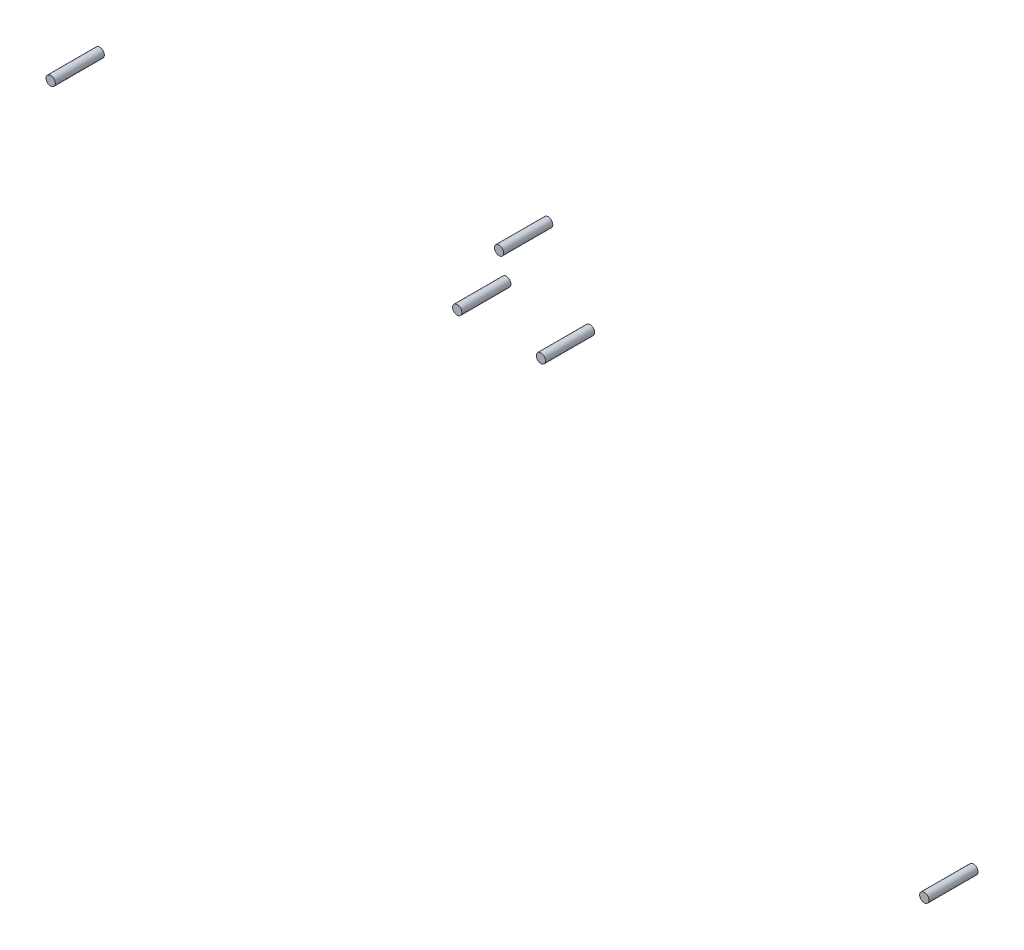
ISO-10303-21;
HEADER;
FILE_DESCRIPTION(('STEP AP214'),'2;1');
FILE_NAME('part.step','',(''),(''),'','','');
FILE_SCHEMA(('AUTOMOTIVE_DESIGN { 1 0 10303 214 1 1 1 1 }'));
ENDSEC;
DATA;
#1=APPLICATION_CONTEXT('core data for automotive mechanical design processes');
#2=APPLICATION_PROTOCOL_DEFINITION('international standard','automotive_design',2000,#1);
#3=PRODUCT_CONTEXT('',#1,'mechanical');
#4=PRODUCT('Part','Part','',(#3));
#5=PRODUCT_RELATED_PRODUCT_CATEGORY('part','',(#4));
#6=PRODUCT_DEFINITION_FORMATION('','',#4);
#7=PRODUCT_DEFINITION_CONTEXT('part definition',#1,'design');
#8=PRODUCT_DEFINITION('design','',#6,#7);
#9=PRODUCT_DEFINITION_SHAPE('','',#8);
#10=(LENGTH_UNIT() NAMED_UNIT(*) SI_UNIT(.MILLI.,.METRE.));
#11=(NAMED_UNIT(*) PLANE_ANGLE_UNIT() SI_UNIT($,.RADIAN.));
#12=(NAMED_UNIT(*) SI_UNIT($,.STERADIAN.) SOLID_ANGLE_UNIT());
#13=UNCERTAINTY_MEASURE_WITH_UNIT(LENGTH_MEASURE(1.E-05),#10,'distance_accuracy_value','');
#14=(GEOMETRIC_REPRESENTATION_CONTEXT(3) GLOBAL_UNCERTAINTY_ASSIGNED_CONTEXT((#13)) GLOBAL_UNIT_ASSIGNED_CONTEXT((#10,
#11,#12)) REPRESENTATION_CONTEXT('',''));
#15=CARTESIAN_POINT('',(0.,0.,0.));
#16=DIRECTION('',(0.,0.,1.));
#17=DIRECTION('',(1.,0.,0.));
#18=AXIS2_PLACEMENT_3D('',#15,#16,#17);
#19=CARTESIAN_POINT('',(-66.4999999999998,49.7499999999999,6.35));
#20=DIRECTION('',(0.,0.,-1.));
#21=DIRECTION('',(-1.,0.,0.));
#22=AXIS2_PLACEMENT_3D('',#19,#20,#21);
#23=CYLINDRICAL_SURFACE('',#22,0.600000000000008);
#24=CARTESIAN_POINT('',(-66.4999999999998,49.7499999999999,6.35));
#25=DIRECTION('',(0.,0.,1.));
#26=DIRECTION('',(1.,0.,0.));
#27=AXIS2_PLACEMENT_3D('',#24,#25,#26);
#28=CIRCLE('',#27,0.600000000000008);
#29=CARTESIAN_POINT('',(-65.8999999999998,49.7499999999999,6.35));
#30=VERTEX_POINT('',#29);
#31=EDGE_CURVE('E11',#30,#30,#28,.T.);
#32=ORIENTED_EDGE('',*,*,#31,.F.);
#33=EDGE_LOOP('',(#32));
#34=FACE_BOUND('',#33,.T.);
#35=CARTESIAN_POINT('',(-66.4999999999998,49.7499999999999,0.));
#36=DIRECTION('',(0.,0.,1.));
#37=DIRECTION('',(1.,0.,0.));
#38=AXIS2_PLACEMENT_3D('',#35,#36,#37);
#39=CIRCLE('',#38,0.600000000000008);
#40=CARTESIAN_POINT('',(-65.8999999999998,49.7499999999999,0.));
#41=VERTEX_POINT('',#40);
#42=EDGE_CURVE('E42',#41,#41,#39,.T.);
#43=ORIENTED_EDGE('',*,*,#42,.T.);
#44=EDGE_LOOP('',(#43));
#45=FACE_BOUND('',#44,.T.);
#46=ADVANCED_FACE('F39',(#34,#45),#23,.T.);
#47=CARTESIAN_POINT('',(-66.4999999999998,49.7499999999999,6.35));
#48=DIRECTION('',(0.,0.,1.));
#49=DIRECTION('',(1.,0.,0.));
#50=AXIS2_PLACEMENT_3D('',#47,#48,#49);
#51=PLANE('',#50);
#52=ORIENTED_EDGE('',*,*,#31,.T.);
#53=EDGE_LOOP('',(#52));
#54=FACE_BOUND('',#53,.T.);
#55=ADVANCED_FACE('F54',(#54),#51,.T.);
#56=CARTESIAN_POINT('',(-66.4999999999998,49.7499999999999,0.));
#57=DIRECTION('',(0.,0.,1.));
#58=DIRECTION('',(1.,0.,0.));
#59=AXIS2_PLACEMENT_3D('',#56,#57,#58);
#60=PLANE('',#59);
#61=ORIENTED_EDGE('',*,*,#42,.F.);
#62=EDGE_LOOP('',(#61));
#63=FACE_BOUND('',#62,.T.);
#64=ADVANCED_FACE('F52',(#63),#60,.F.);
#65=CLOSED_SHELL('',(#46,#55,#64));
#66=MANIFOLD_SOLID_BREP('B2',#65);
#67=CARTESIAN_POINT('',(46.5000000000002,14.7499999999999,6.35));
#68=DIRECTION('',(0.,0.,-1.));
#69=DIRECTION('',(-1.,0.,0.));
#70=AXIS2_PLACEMENT_3D('',#67,#68,#69);
#71=CYLINDRICAL_SURFACE('',#70,0.599999999999992);
#72=CARTESIAN_POINT('',(46.5000000000002,14.7499999999999,6.35));
#73=DIRECTION('',(0.,0.,1.));
#74=DIRECTION('',(1.,0.,0.));
#75=AXIS2_PLACEMENT_3D('',#72,#73,#74);
#76=CIRCLE('',#75,0.599999999999992);
#77=CARTESIAN_POINT('',(47.1000000000002,14.7499999999999,6.35));
#78=VERTEX_POINT('',#77);
#79=EDGE_CURVE('E38',#78,#78,#76,.T.);
#80=ORIENTED_EDGE('',*,*,#79,.F.);
#81=EDGE_LOOP('',(#80));
#82=FACE_BOUND('',#81,.T.);
#83=CARTESIAN_POINT('',(46.5000000000002,14.7499999999999,0.));
#84=DIRECTION('',(0.,0.,1.));
#85=DIRECTION('',(1.,0.,0.));
#86=AXIS2_PLACEMENT_3D('',#83,#84,#85);
#87=CIRCLE('',#86,0.599999999999992);
#88=CARTESIAN_POINT('',(47.1000000000002,14.7499999999999,0.));
#89=VERTEX_POINT('',#88);
#90=EDGE_CURVE('E90',#89,#89,#87,.T.);
#91=ORIENTED_EDGE('',*,*,#90,.T.);
#92=EDGE_LOOP('',(#91));
#93=FACE_BOUND('',#92,.T.);
#94=ADVANCED_FACE('F87',(#82,#93),#71,.T.);
#95=CARTESIAN_POINT('',(46.5000000000002,14.7499999999999,6.35));
#96=DIRECTION('',(0.,0.,1.));
#97=DIRECTION('',(1.,0.,0.));
#98=AXIS2_PLACEMENT_3D('',#95,#96,#97);
#99=PLANE('',#98);
#100=ORIENTED_EDGE('',*,*,#79,.T.);
#101=EDGE_LOOP('',(#100));
#102=FACE_BOUND('',#101,.T.);
#103=ADVANCED_FACE('F102',(#102),#99,.T.);
#104=CARTESIAN_POINT('',(46.5000000000002,14.7499999999999,0.));
#105=DIRECTION('',(0.,0.,1.));
#106=DIRECTION('',(1.,0.,0.));
#107=AXIS2_PLACEMENT_3D('',#104,#105,#106);
#108=PLANE('',#107);
#109=ORIENTED_EDGE('',*,*,#90,.F.);
#110=EDGE_LOOP('',(#109));
#111=FACE_BOUND('',#110,.T.);
#112=ADVANCED_FACE('F100',(#111),#108,.F.);
#113=CLOSED_SHELL('',(#94,#103,#112));
#114=MANIFOLD_SOLID_BREP('B6',#113);
#115=CARTESIAN_POINT('',(-13.9126587736516,50.3749999999999,6.35));
#116=DIRECTION('',(0.,0.,-1.));
#117=DIRECTION('',(-1.,0.,0.));
#118=AXIS2_PLACEMENT_3D('',#115,#116,#117);
#119=CYLINDRICAL_SURFACE('',#118,0.599999999998915);
#120=CARTESIAN_POINT('',(-13.9126587736516,50.3749999999999,6.35));
#121=DIRECTION('',(0.,0.,1.));
#122=DIRECTION('',(1.,0.,0.));
#123=AXIS2_PLACEMENT_3D('',#120,#121,#122);
#124=CIRCLE('',#123,0.599999999998915);
#125=CARTESIAN_POINT('',(-13.3126587736527,50.3749999999999,6.35));
#126=VERTEX_POINT('',#125);
#127=EDGE_CURVE('E86',#126,#126,#124,.T.);
#128=ORIENTED_EDGE('',*,*,#127,.F.);
#129=EDGE_LOOP('',(#128));
#130=FACE_BOUND('',#129,.T.);
#131=CARTESIAN_POINT('',(-13.9126587736516,50.3749999999999,0.));
#132=DIRECTION('',(0.,0.,1.));
#133=DIRECTION('',(1.,0.,0.));
#134=AXIS2_PLACEMENT_3D('',#131,#132,#133);
#135=CIRCLE('',#134,0.599999999998915);
#136=CARTESIAN_POINT('',(-13.3126587736527,50.3749999999999,0.));
#137=VERTEX_POINT('',#136);
#138=EDGE_CURVE('E138',#137,#137,#135,.T.);
#139=ORIENTED_EDGE('',*,*,#138,.T.);
#140=EDGE_LOOP('',(#139));
#141=FACE_BOUND('',#140,.T.);
#142=ADVANCED_FACE('F135',(#130,#141),#119,.T.);
#143=CARTESIAN_POINT('',(-13.9126587736516,50.3749999999999,6.35));
#144=DIRECTION('',(0.,0.,1.));
#145=DIRECTION('',(1.,0.,0.));
#146=AXIS2_PLACEMENT_3D('',#143,#144,#145);
#147=PLANE('',#146);
#148=ORIENTED_EDGE('',*,*,#127,.T.);
#149=EDGE_LOOP('',(#148));
#150=FACE_BOUND('',#149,.T.);
#151=ADVANCED_FACE('F150',(#150),#147,.T.);
#152=CARTESIAN_POINT('',(-13.9126587736516,50.3749999999999,0.));
#153=DIRECTION('',(0.,0.,1.));
#154=DIRECTION('',(1.,0.,0.));
#155=AXIS2_PLACEMENT_3D('',#152,#153,#154);
#156=PLANE('',#155);
#157=ORIENTED_EDGE('',*,*,#138,.F.);
#158=EDGE_LOOP('',(#157));
#159=FACE_BOUND('',#158,.T.);
#160=ADVANCED_FACE('F148',(#159),#156,.F.);
#161=CLOSED_SHELL('',(#142,#151,#160));
#162=MANIFOLD_SOLID_BREP('B33',#161);
#163=CARTESIAN_POINT('',(-8.49999999999863,59.7499999999999,6.35));
#164=DIRECTION('',(0.,0.,-1.));
#165=DIRECTION('',(-1.,0.,0.));
#166=AXIS2_PLACEMENT_3D('',#163,#164,#165);
#167=CYLINDRICAL_SURFACE('',#166,0.599999999998915);
#168=CARTESIAN_POINT('',(-8.49999999999863,59.7499999999999,6.35));
#169=DIRECTION('',(0.,0.,1.));
#170=DIRECTION('',(1.,0.,0.));
#171=AXIS2_PLACEMENT_3D('',#168,#169,#170);
#172=CIRCLE('',#171,0.599999999998915);
#173=CARTESIAN_POINT('',(-7.89999999999971,59.7499999999999,6.35));
#174=VERTEX_POINT('',#173);
#175=EDGE_CURVE('E134',#174,#174,#172,.T.);
#176=ORIENTED_EDGE('',*,*,#175,.F.);
#177=EDGE_LOOP('',(#176));
#178=FACE_BOUND('',#177,.T.);
#179=CARTESIAN_POINT('',(-8.49999999999863,59.7499999999999,0.));
#180=DIRECTION('',(0.,0.,1.));
#181=DIRECTION('',(1.,0.,0.));
#182=AXIS2_PLACEMENT_3D('',#179,#180,#181);
#183=CIRCLE('',#182,0.599999999998915);
#184=CARTESIAN_POINT('',(-7.89999999999971,59.7499999999999,0.));
#185=VERTEX_POINT('',#184);
#186=EDGE_CURVE('E185',#185,#185,#183,.T.);
#187=ORIENTED_EDGE('',*,*,#186,.T.);
#188=EDGE_LOOP('',(#187));
#189=FACE_BOUND('',#188,.T.);
#190=ADVANCED_FACE('F182',(#178,#189),#167,.T.);
#191=CARTESIAN_POINT('',(-8.49999999999863,59.7499999999999,6.35));
#192=DIRECTION('',(0.,0.,1.));
#193=DIRECTION('',(1.,0.,0.));
#194=AXIS2_PLACEMENT_3D('',#191,#192,#193);
#195=PLANE('',#194);
#196=ORIENTED_EDGE('',*,*,#175,.T.);
#197=EDGE_LOOP('',(#196));
#198=FACE_BOUND('',#197,.T.);
#199=ADVANCED_FACE('F197',(#198),#195,.T.);
#200=CARTESIAN_POINT('',(-8.49999999999863,59.7499999999999,0.));
#201=DIRECTION('',(0.,0.,1.));
#202=DIRECTION('',(1.,0.,0.));
#203=AXIS2_PLACEMENT_3D('',#200,#201,#202);
#204=PLANE('',#203);
#205=ORIENTED_EDGE('',*,*,#186,.F.);
#206=EDGE_LOOP('',(#205));
#207=FACE_BOUND('',#206,.T.);
#208=ADVANCED_FACE('F195',(#207),#204,.F.);
#209=CLOSED_SHELL('',(#190,#199,#208));
#210=MANIFOLD_SOLID_BREP('B81',#209);
#211=CARTESIAN_POINT('',(-3.08734122634562,50.3749999999999,6.35));
#212=DIRECTION('',(0.,0.,-1.));
#213=DIRECTION('',(-1.,0.,0.));
#214=AXIS2_PLACEMENT_3D('',#211,#212,#213);
#215=CYLINDRICAL_SURFACE('',#214,0.599999999999177);
#216=CARTESIAN_POINT('',(-3.08734122634562,50.3749999999999,6.35));
#217=DIRECTION('',(0.,0.,1.));
#218=DIRECTION('',(1.,0.,0.));
#219=AXIS2_PLACEMENT_3D('',#216,#217,#218);
#220=CIRCLE('',#219,0.599999999999177);
#221=CARTESIAN_POINT('',(-2.48734122634644,50.3749999999999,6.35));
#222=VERTEX_POINT('',#221);
#223=EDGE_CURVE('E181',#222,#222,#220,.T.);
#224=ORIENTED_EDGE('',*,*,#223,.F.);
#225=EDGE_LOOP('',(#224));
#226=FACE_BOUND('',#225,.T.);
#227=CARTESIAN_POINT('',(-3.08734122634562,50.3749999999999,0.));
#228=DIRECTION('',(0.,0.,1.));
#229=DIRECTION('',(1.,0.,0.));
#230=AXIS2_PLACEMENT_3D('',#227,#228,#229);
#231=CIRCLE('',#230,0.599999999999177);
#232=CARTESIAN_POINT('',(-2.48734122634644,50.3749999999999,0.));
#233=VERTEX_POINT('',#232);
#234=EDGE_CURVE('E225',#233,#233,#231,.T.);
#235=ORIENTED_EDGE('',*,*,#234,.T.);
#236=EDGE_LOOP('',(#235));
#237=FACE_BOUND('',#236,.T.);
#238=ADVANCED_FACE('F222',(#226,#237),#215,.T.);
#239=CARTESIAN_POINT('',(-3.08734122634562,50.3749999999999,6.35));
#240=DIRECTION('',(0.,0.,1.));
#241=DIRECTION('',(1.,0.,0.));
#242=AXIS2_PLACEMENT_3D('',#239,#240,#241);
#243=PLANE('',#242);
#244=ORIENTED_EDGE('',*,*,#223,.T.);
#245=EDGE_LOOP('',(#244));
#246=FACE_BOUND('',#245,.T.);
#247=ADVANCED_FACE('F237',(#246),#243,.T.);
#248=CARTESIAN_POINT('',(-3.08734122634562,50.3749999999999,0.));
#249=DIRECTION('',(0.,0.,1.));
#250=DIRECTION('',(1.,0.,0.));
#251=AXIS2_PLACEMENT_3D('',#248,#249,#250);
#252=PLANE('',#251);
#253=ORIENTED_EDGE('',*,*,#234,.F.);
#254=EDGE_LOOP('',(#253));
#255=FACE_BOUND('',#254,.T.);
#256=ADVANCED_FACE('F235',(#255),#252,.F.);
#257=CLOSED_SHELL('',(#238,#247,#256));
#258=MANIFOLD_SOLID_BREP('B129',#257);
#259=ADVANCED_BREP_SHAPE_REPRESENTATION('',(#18,#66,#114,#162,#210,#258),#14);
#260=SHAPE_DEFINITION_REPRESENTATION(#9,#259);
ENDSEC;
END-ISO-10303-21;
